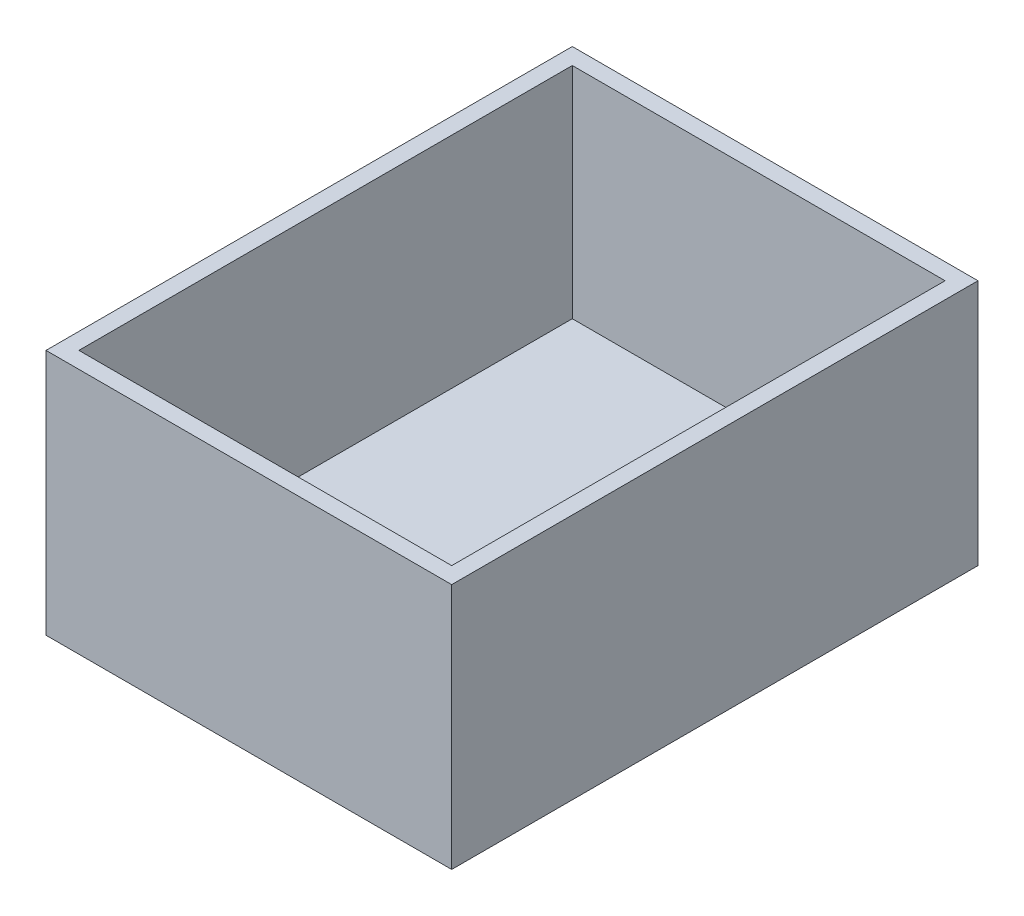
ISO-10303-21;
HEADER;
FILE_DESCRIPTION(('STEP AP214'),'2;1');
FILE_NAME('part.step','',(''),(''),'','','');
FILE_SCHEMA(('AUTOMOTIVE_DESIGN { 1 0 10303 214 1 1 1 1 }'));
ENDSEC;
DATA;
#1=APPLICATION_CONTEXT('core data for automotive mechanical design processes');
#2=APPLICATION_PROTOCOL_DEFINITION('international standard','automotive_design',2000,#1);
#3=PRODUCT_CONTEXT('',#1,'mechanical');
#4=PRODUCT('Part','Part','',(#3));
#5=PRODUCT_RELATED_PRODUCT_CATEGORY('part','',(#4));
#6=PRODUCT_DEFINITION_FORMATION('','',#4);
#7=PRODUCT_DEFINITION_CONTEXT('part definition',#1,'design');
#8=PRODUCT_DEFINITION('design','',#6,#7);
#9=PRODUCT_DEFINITION_SHAPE('','',#8);
#10=(LENGTH_UNIT() NAMED_UNIT(*) SI_UNIT(.MILLI.,.METRE.));
#11=(NAMED_UNIT(*) PLANE_ANGLE_UNIT() SI_UNIT($,.RADIAN.));
#12=(NAMED_UNIT(*) SI_UNIT($,.STERADIAN.) SOLID_ANGLE_UNIT());
#13=UNCERTAINTY_MEASURE_WITH_UNIT(LENGTH_MEASURE(1.E-05),#10,'distance_accuracy_value','');
#14=(GEOMETRIC_REPRESENTATION_CONTEXT(3) GLOBAL_UNCERTAINTY_ASSIGNED_CONTEXT((#13)) GLOBAL_UNIT_ASSIGNED_CONTEXT((#10,
#11,#12)) REPRESENTATION_CONTEXT('',''));
#15=CARTESIAN_POINT('',(0.,0.,0.));
#16=DIRECTION('',(0.,0.,1.));
#17=DIRECTION('',(1.,0.,0.));
#18=AXIS2_PLACEMENT_3D('',#15,#16,#17);
#19=CARTESIAN_POINT('',(0.,45.,0.));
#20=DIRECTION('',(1.,0.,0.));
#21=DIRECTION('',(0.,0.,-1.));
#22=AXIS2_PLACEMENT_3D('',#19,#20,#21);
#23=PLANE('',#22);
#24=DIRECTION('',(0.,0.,1.));
#25=VECTOR('',#24,1.);
#26=CARTESIAN_POINT('',(0.,0.,0.));
#27=LINE('',#26,#25);
#28=CARTESIAN_POINT('',(0.,0.,0.));
#29=VERTEX_POINT('',#28);
#30=CARTESIAN_POINT('',(0.,0.,96.));
#31=VERTEX_POINT('',#30);
#32=EDGE_CURVE('E148',#29,#31,#27,.T.);
#33=ORIENTED_EDGE('',*,*,#32,.T.);
#34=DIRECTION('',(0.,-1.,0.));
#35=VECTOR('',#34,1.);
#36=CARTESIAN_POINT('',(0.,45.,96.));
#37=LINE('',#36,#35);
#38=CARTESIAN_POINT('',(0.,45.,96.));
#39=VERTEX_POINT('',#38);
#40=EDGE_CURVE('E11',#39,#31,#37,.T.);
#41=ORIENTED_EDGE('',*,*,#40,.F.);
#42=DIRECTION('',(0.,0.,1.));
#43=VECTOR('',#42,1.);
#44=CARTESIAN_POINT('',(0.,45.,0.));
#45=LINE('',#44,#43);
#46=CARTESIAN_POINT('',(0.,45.,0.));
#47=VERTEX_POINT('',#46);
#48=EDGE_CURVE('E152',#47,#39,#45,.T.);
#49=ORIENTED_EDGE('',*,*,#48,.F.);
#50=DIRECTION('',(0.,-1.,0.));
#51=VECTOR('',#50,1.);
#52=CARTESIAN_POINT('',(0.,45.,0.));
#53=LINE('',#52,#51);
#54=EDGE_CURVE('E158',#47,#29,#53,.T.);
#55=ORIENTED_EDGE('',*,*,#54,.T.);
#56=EDGE_LOOP('',(#33,#41,#49,#55));
#57=FACE_BOUND('',#56,.T.);
#58=ADVANCED_FACE('F37',(#57),#23,.F.);
#59=CARTESIAN_POINT('',(0.,45.,96.));
#60=DIRECTION('',(0.,0.,-1.));
#61=DIRECTION('',(-1.,0.,0.));
#62=AXIS2_PLACEMENT_3D('',#59,#60,#61);
#63=PLANE('',#62);
#64=DIRECTION('',(1.,0.,0.));
#65=VECTOR('',#64,1.);
#66=CARTESIAN_POINT('',(0.,0.,96.));
#67=LINE('',#66,#65);
#68=CARTESIAN_POINT('',(74.,0.,96.));
#69=VERTEX_POINT('',#68);
#70=EDGE_CURVE('E161',#31,#69,#67,.T.);
#71=ORIENTED_EDGE('',*,*,#70,.T.);
#72=DIRECTION('',(0.,-1.,0.));
#73=VECTOR('',#72,1.);
#74=CARTESIAN_POINT('',(74.,45.,96.));
#75=LINE('',#74,#73);
#76=CARTESIAN_POINT('',(74.,45.,96.));
#77=VERTEX_POINT('',#76);
#78=EDGE_CURVE('E45',#77,#69,#75,.T.);
#79=ORIENTED_EDGE('',*,*,#78,.F.);
#80=DIRECTION('',(1.,0.,0.));
#81=VECTOR('',#80,1.);
#82=CARTESIAN_POINT('',(0.,45.,96.));
#83=LINE('',#82,#81);
#84=EDGE_CURVE('E89',#39,#77,#83,.T.);
#85=ORIENTED_EDGE('',*,*,#84,.F.);
#86=ORIENTED_EDGE('',*,*,#40,.T.);
#87=EDGE_LOOP('',(#71,#79,#85,#86));
#88=FACE_BOUND('',#87,.T.);
#89=ADVANCED_FACE('F191',(#88),#63,.F.);
#90=CARTESIAN_POINT('',(74.,45.,0.));
#91=DIRECTION('',(-1.,0.,0.));
#92=DIRECTION('',(0.,0.,1.));
#93=AXIS2_PLACEMENT_3D('',#90,#91,#92);
#94=PLANE('',#93);
#95=DIRECTION('',(0.,0.,-1.));
#96=VECTOR('',#95,1.);
#97=CARTESIAN_POINT('',(74.,0.,0.));
#98=LINE('',#97,#96);
#99=CARTESIAN_POINT('',(74.,0.,0.));
#100=VERTEX_POINT('',#99);
#101=EDGE_CURVE('E163',#69,#100,#98,.T.);
#102=ORIENTED_EDGE('',*,*,#101,.T.);
#103=DIRECTION('',(0.,-1.,0.));
#104=VECTOR('',#103,1.);
#105=CARTESIAN_POINT('',(74.,45.,0.));
#106=LINE('',#105,#104);
#107=CARTESIAN_POINT('',(74.,45.,0.));
#108=VERTEX_POINT('',#107);
#109=EDGE_CURVE('E167',#108,#100,#106,.T.);
#110=ORIENTED_EDGE('',*,*,#109,.F.);
#111=DIRECTION('',(0.,0.,-1.));
#112=VECTOR('',#111,1.);
#113=CARTESIAN_POINT('',(74.,45.,0.));
#114=LINE('',#113,#112);
#115=EDGE_CURVE('E155',#77,#108,#114,.T.);
#116=ORIENTED_EDGE('',*,*,#115,.F.);
#117=ORIENTED_EDGE('',*,*,#78,.T.);
#118=EDGE_LOOP('',(#102,#110,#116,#117));
#119=FACE_BOUND('',#118,.T.);
#120=ADVANCED_FACE('F173',(#119),#94,.F.);
#121=CARTESIAN_POINT('',(0.,45.,0.));
#122=DIRECTION('',(0.,0.,1.));
#123=DIRECTION('',(1.,0.,0.));
#124=AXIS2_PLACEMENT_3D('',#121,#122,#123);
#125=PLANE('',#124);
#126=DIRECTION('',(-1.,0.,0.));
#127=VECTOR('',#126,1.);
#128=CARTESIAN_POINT('',(0.,0.,0.));
#129=LINE('',#128,#127);
#130=EDGE_CURVE('E82',#100,#29,#129,.T.);
#131=ORIENTED_EDGE('',*,*,#130,.T.);
#132=ORIENTED_EDGE('',*,*,#54,.F.);
#133=DIRECTION('',(-1.,0.,0.));
#134=VECTOR('',#133,1.);
#135=CARTESIAN_POINT('',(0.,45.,0.));
#136=LINE('',#135,#134);
#137=EDGE_CURVE('E61',#108,#47,#136,.T.);
#138=ORIENTED_EDGE('',*,*,#137,.F.);
#139=ORIENTED_EDGE('',*,*,#109,.T.);
#140=EDGE_LOOP('',(#131,#132,#138,#139));
#141=FACE_BOUND('',#140,.T.);
#142=ADVANCED_FACE('F181',(#141),#125,.F.);
#143=CARTESIAN_POINT('',(0.,45.,0.));
#144=DIRECTION('',(0.,1.,0.));
#145=DIRECTION('',(0.,0.,1.));
#146=AXIS2_PLACEMENT_3D('',#143,#144,#145);
#147=PLANE('',#146);
#148=DIRECTION('',(-1.,0.,0.));
#149=VECTOR('',#148,1.);
#150=CARTESIAN_POINT('',(71.,45.,3.));
#151=LINE('',#150,#149);
#152=CARTESIAN_POINT('',(71.,45.,3.));
#153=VERTEX_POINT('',#152);
#154=CARTESIAN_POINT('',(3.,45.,3.));
#155=VERTEX_POINT('',#154);
#156=EDGE_CURVE('E52',#153,#155,#151,.T.);
#157=ORIENTED_EDGE('',*,*,#156,.F.);
#158=DIRECTION('',(0.,0.,-1.));
#159=VECTOR('',#158,1.);
#160=CARTESIAN_POINT('',(71.,45.,93.));
#161=LINE('',#160,#159);
#162=CARTESIAN_POINT('',(71.,45.,93.));
#163=VERTEX_POINT('',#162);
#164=EDGE_CURVE('E131',#163,#153,#161,.T.);
#165=ORIENTED_EDGE('',*,*,#164,.F.);
#166=DIRECTION('',(1.,0.,0.));
#167=VECTOR('',#166,1.);
#168=CARTESIAN_POINT('',(3.00000000000001,45.,93.));
#169=LINE('',#168,#167);
#170=CARTESIAN_POINT('',(3.00000000000001,45.,93.));
#171=VERTEX_POINT('',#170);
#172=EDGE_CURVE('E134',#171,#163,#169,.T.);
#173=ORIENTED_EDGE('',*,*,#172,.F.);
#174=DIRECTION('',(0.,0.,1.));
#175=VECTOR('',#174,1.);
#176=CARTESIAN_POINT('',(3.,45.,3.));
#177=LINE('',#176,#175);
#178=EDGE_CURVE('E142',#155,#171,#177,.T.);
#179=ORIENTED_EDGE('',*,*,#178,.F.);
#180=EDGE_LOOP('',(#157,#165,#173,#179));
#181=FACE_BOUND('',#180,.T.);
#182=ORIENTED_EDGE('',*,*,#48,.T.);
#183=ORIENTED_EDGE('',*,*,#84,.T.);
#184=ORIENTED_EDGE('',*,*,#115,.T.);
#185=ORIENTED_EDGE('',*,*,#137,.T.);
#186=EDGE_LOOP('',(#182,#183,#184,#185));
#187=FACE_BOUND('',#186,.T.);
#188=ADVANCED_FACE('F183',(#181,#187),#147,.T.);
#189=CARTESIAN_POINT('',(0.,0.,0.));
#190=DIRECTION('',(0.,1.,0.));
#191=DIRECTION('',(0.,0.,1.));
#192=AXIS2_PLACEMENT_3D('',#189,#190,#191);
#193=PLANE('',#192);
#194=CARTESIAN_POINT('',(64.4,0.,50.));
#195=DIRECTION('',(0.,-1.,0.));
#196=DIRECTION('',(0.,0.,-1.));
#197=AXIS2_PLACEMENT_3D('',#194,#195,#196);
#198=CIRCLE('',#197,5.00000000000001);
#199=CARTESIAN_POINT('',(64.4,0.,45.));
#200=VERTEX_POINT('',#199);
#201=EDGE_CURVE('E137',#200,#200,#198,.T.);
#202=ORIENTED_EDGE('',*,*,#201,.F.);
#203=EDGE_LOOP('',(#202));
#204=FACE_BOUND('',#203,.T.);
#205=ORIENTED_EDGE('',*,*,#32,.F.);
#206=ORIENTED_EDGE('',*,*,#130,.F.);
#207=ORIENTED_EDGE('',*,*,#101,.F.);
#208=ORIENTED_EDGE('',*,*,#70,.F.);
#209=EDGE_LOOP('',(#205,#206,#207,#208));
#210=FACE_BOUND('',#209,.T.);
#211=ADVANCED_FACE('F177',(#204,#210),#193,.F.);
#212=CARTESIAN_POINT('',(71.,5.,3.));
#213=DIRECTION('',(0.,0.,-1.));
#214=DIRECTION('',(-1.,0.,0.));
#215=AXIS2_PLACEMENT_3D('',#212,#213,#214);
#216=PLANE('',#215);
#217=ORIENTED_EDGE('',*,*,#156,.T.);
#218=DIRECTION('',(0.,1.,0.));
#219=VECTOR('',#218,1.);
#220=CARTESIAN_POINT('',(3.,5.,3.));
#221=LINE('',#220,#219);
#222=CARTESIAN_POINT('',(3.,5.,3.));
#223=VERTEX_POINT('',#222);
#224=EDGE_CURVE('E109',#223,#155,#221,.T.);
#225=ORIENTED_EDGE('',*,*,#224,.F.);
#226=DIRECTION('',(-1.,0.,0.));
#227=VECTOR('',#226,1.);
#228=CARTESIAN_POINT('',(71.,5.,3.));
#229=LINE('',#228,#227);
#230=CARTESIAN_POINT('',(71.,5.,3.));
#231=VERTEX_POINT('',#230);
#232=EDGE_CURVE('E113',#231,#223,#229,.T.);
#233=ORIENTED_EDGE('',*,*,#232,.F.);
#234=DIRECTION('',(0.,1.,0.));
#235=VECTOR('',#234,1.);
#236=CARTESIAN_POINT('',(71.,5.,3.));
#237=LINE('',#236,#235);
#238=EDGE_CURVE('E146',#231,#153,#237,.T.);
#239=ORIENTED_EDGE('',*,*,#238,.T.);
#240=EDGE_LOOP('',(#217,#225,#233,#239));
#241=FACE_BOUND('',#240,.T.);
#242=ADVANCED_FACE('F111',(#241),#216,.F.);
#243=CARTESIAN_POINT('',(71.,5.,93.));
#244=DIRECTION('',(1.,0.,0.));
#245=DIRECTION('',(0.,0.,-1.));
#246=AXIS2_PLACEMENT_3D('',#243,#244,#245);
#247=PLANE('',#246);
#248=ORIENTED_EDGE('',*,*,#164,.T.);
#249=ORIENTED_EDGE('',*,*,#238,.F.);
#250=DIRECTION('',(0.,0.,-1.));
#251=VECTOR('',#250,1.);
#252=CARTESIAN_POINT('',(71.,5.,93.));
#253=LINE('',#252,#251);
#254=CARTESIAN_POINT('',(71.,5.,93.));
#255=VERTEX_POINT('',#254);
#256=EDGE_CURVE('E119',#255,#231,#253,.T.);
#257=ORIENTED_EDGE('',*,*,#256,.F.);
#258=DIRECTION('',(0.,1.,0.));
#259=VECTOR('',#258,1.);
#260=CARTESIAN_POINT('',(71.,5.,93.));
#261=LINE('',#260,#259);
#262=EDGE_CURVE('E149',#255,#163,#261,.T.);
#263=ORIENTED_EDGE('',*,*,#262,.T.);
#264=EDGE_LOOP('',(#248,#249,#257,#263));
#265=FACE_BOUND('',#264,.T.);
#266=ADVANCED_FACE('F225',(#265),#247,.F.);
#267=CARTESIAN_POINT('',(3.00000000000001,5.,93.));
#268=DIRECTION('',(0.,0.,1.));
#269=DIRECTION('',(1.,0.,0.));
#270=AXIS2_PLACEMENT_3D('',#267,#268,#269);
#271=PLANE('',#270);
#272=ORIENTED_EDGE('',*,*,#172,.T.);
#273=ORIENTED_EDGE('',*,*,#262,.F.);
#274=DIRECTION('',(1.,0.,0.));
#275=VECTOR('',#274,1.);
#276=CARTESIAN_POINT('',(3.00000000000001,5.,93.));
#277=LINE('',#276,#275);
#278=CARTESIAN_POINT('',(3.00000000000001,5.,93.));
#279=VERTEX_POINT('',#278);
#280=EDGE_CURVE('E127',#279,#255,#277,.T.);
#281=ORIENTED_EDGE('',*,*,#280,.F.);
#282=DIRECTION('',(0.,1.,0.));
#283=VECTOR('',#282,1.);
#284=CARTESIAN_POINT('',(3.00000000000001,5.,93.));
#285=LINE('',#284,#283);
#286=EDGE_CURVE('E118',#279,#171,#285,.T.);
#287=ORIENTED_EDGE('',*,*,#286,.T.);
#288=EDGE_LOOP('',(#272,#273,#281,#287));
#289=FACE_BOUND('',#288,.T.);
#290=ADVANCED_FACE('F234',(#289),#271,.F.);
#291=CARTESIAN_POINT('',(3.,5.,3.));
#292=DIRECTION('',(-1.,0.,0.));
#293=DIRECTION('',(0.,0.,1.));
#294=AXIS2_PLACEMENT_3D('',#291,#292,#293);
#295=PLANE('',#294);
#296=ORIENTED_EDGE('',*,*,#178,.T.);
#297=ORIENTED_EDGE('',*,*,#286,.F.);
#298=DIRECTION('',(0.,0.,1.));
#299=VECTOR('',#298,1.);
#300=CARTESIAN_POINT('',(3.,5.,3.));
#301=LINE('',#300,#299);
#302=EDGE_CURVE('E122',#223,#279,#301,.T.);
#303=ORIENTED_EDGE('',*,*,#302,.F.);
#304=ORIENTED_EDGE('',*,*,#224,.T.);
#305=EDGE_LOOP('',(#296,#297,#303,#304));
#306=FACE_BOUND('',#305,.T.);
#307=ADVANCED_FACE('F123',(#306),#295,.F.);
#308=CARTESIAN_POINT('',(0.,5.,0.));
#309=DIRECTION('',(0.,1.,0.));
#310=DIRECTION('',(0.,0.,1.));
#311=AXIS2_PLACEMENT_3D('',#308,#309,#310);
#312=PLANE('',#311);
#313=CARTESIAN_POINT('',(64.4,5.,50.));
#314=DIRECTION('',(0.,1.,0.));
#315=DIRECTION('',(0.,0.,1.));
#316=AXIS2_PLACEMENT_3D('',#313,#314,#315);
#317=CIRCLE('',#316,5.00000000000001);
#318=CARTESIAN_POINT('',(64.4,5.,55.));
#319=VERTEX_POINT('',#318);
#320=EDGE_CURVE('E40',#319,#319,#317,.T.);
#321=ORIENTED_EDGE('',*,*,#320,.F.);
#322=EDGE_LOOP('',(#321));
#323=FACE_BOUND('',#322,.T.);
#324=ORIENTED_EDGE('',*,*,#232,.T.);
#325=ORIENTED_EDGE('',*,*,#302,.T.);
#326=ORIENTED_EDGE('',*,*,#280,.T.);
#327=ORIENTED_EDGE('',*,*,#256,.T.);
#328=EDGE_LOOP('',(#324,#325,#326,#327));
#329=FACE_BOUND('',#328,.T.);
#330=ADVANCED_FACE('F129',(#323,#329),#312,.T.);
#331=CARTESIAN_POINT('',(64.4,10.,50.));
#332=DIRECTION('',(0.,-1.,0.));
#333=DIRECTION('',(0.,0.,-1.));
#334=AXIS2_PLACEMENT_3D('',#331,#332,#333);
#335=CYLINDRICAL_SURFACE('',#334,5.00000000000001);
#336=ORIENTED_EDGE('',*,*,#320,.T.);
#337=EDGE_LOOP('',(#336));
#338=FACE_BOUND('',#337,.T.);
#339=ORIENTED_EDGE('',*,*,#201,.T.);
#340=EDGE_LOOP('',(#339));
#341=FACE_BOUND('',#340,.T.);
#342=ADVANCED_FACE('F267',(#338,#341),#335,.F.);
#343=CLOSED_SHELL('',(#58,#89,#120,#142,#188,#211,#242,#266,#290,#307,#330,#342));
#344=MANIFOLD_SOLID_BREP('B2',#343);
#345=ADVANCED_BREP_SHAPE_REPRESENTATION('',(#18,#344),#14);
#346=SHAPE_DEFINITION_REPRESENTATION(#9,#345);
ENDSEC;
END-ISO-10303-21;
